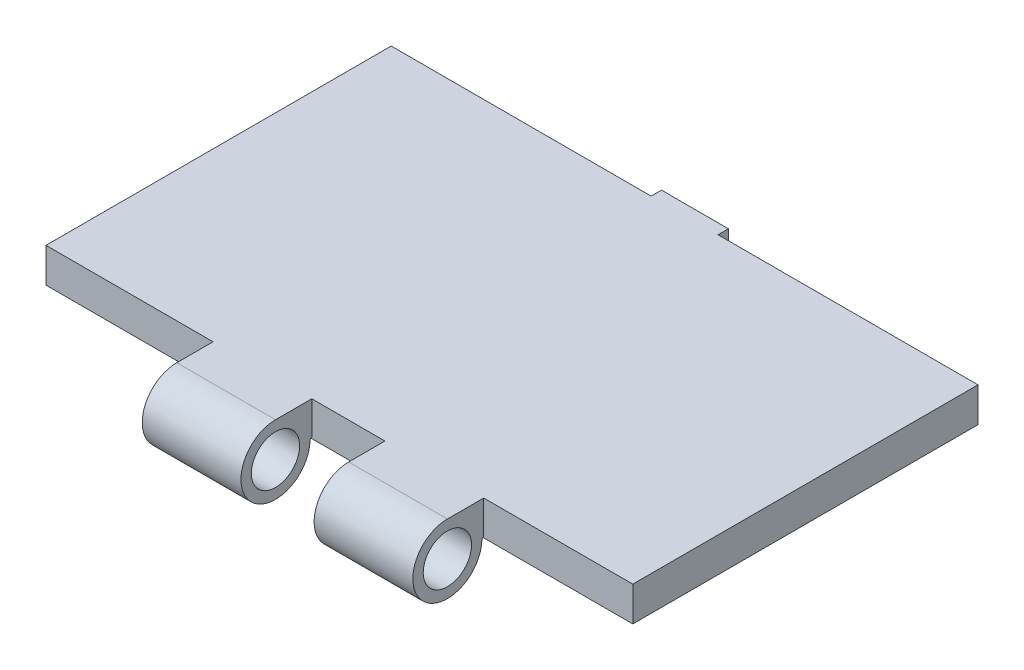
ISO-10303-21;
HEADER;
FILE_DESCRIPTION(('STEP AP214'),'2;1');
FILE_NAME('part.step','',(''),(''),'','','');
FILE_SCHEMA(('AUTOMOTIVE_DESIGN { 1 0 10303 214 1 1 1 1 }'));
ENDSEC;
DATA;
#1=APPLICATION_CONTEXT('core data for automotive mechanical design processes');
#2=APPLICATION_PROTOCOL_DEFINITION('international standard','automotive_design',2000,#1);
#3=PRODUCT_CONTEXT('',#1,'mechanical');
#4=PRODUCT('Part','Part','',(#3));
#5=PRODUCT_RELATED_PRODUCT_CATEGORY('part','',(#4));
#6=PRODUCT_DEFINITION_FORMATION('','',#4);
#7=PRODUCT_DEFINITION_CONTEXT('part definition',#1,'design');
#8=PRODUCT_DEFINITION('design','',#6,#7);
#9=PRODUCT_DEFINITION_SHAPE('','',#8);
#10=(LENGTH_UNIT() NAMED_UNIT(*) SI_UNIT(.MILLI.,.METRE.));
#11=(NAMED_UNIT(*) PLANE_ANGLE_UNIT() SI_UNIT($,.RADIAN.));
#12=(NAMED_UNIT(*) SI_UNIT($,.STERADIAN.) SOLID_ANGLE_UNIT());
#13=UNCERTAINTY_MEASURE_WITH_UNIT(LENGTH_MEASURE(1.E-05),#10,'distance_accuracy_value','');
#14=(GEOMETRIC_REPRESENTATION_CONTEXT(3) GLOBAL_UNCERTAINTY_ASSIGNED_CONTEXT((#13)) GLOBAL_UNIT_ASSIGNED_CONTEXT((#10,
#11,#12)) REPRESENTATION_CONTEXT('',''));
#15=CARTESIAN_POINT('',(0.,0.,0.));
#16=DIRECTION('',(0.,0.,1.));
#17=DIRECTION('',(1.,0.,0.));
#18=AXIS2_PLACEMENT_3D('',#15,#16,#17);
#19=CARTESIAN_POINT('',(-42.5,5.,-25.));
#20=DIRECTION('',(0.,0.,1.));
#21=DIRECTION('',(1.,0.,0.));
#22=AXIS2_PLACEMENT_3D('',#19,#20,#21);
#23=PLANE('',#22);
#24=DIRECTION('',(0.,-1.,0.));
#25=VECTOR('',#24,1.);
#26=CARTESIAN_POINT('',(-4.85,5.,-25.));
#27=LINE('',#26,#25);
#28=CARTESIAN_POINT('',(-4.85,5.,-25.));
#29=VERTEX_POINT('',#28);
#30=CARTESIAN_POINT('',(-4.85,0.,-25.));
#31=VERTEX_POINT('',#30);
#32=EDGE_CURVE('E184',#29,#31,#27,.T.);
#33=ORIENTED_EDGE('',*,*,#32,.T.);
#34=DIRECTION('',(-1.,0.,0.));
#35=VECTOR('',#34,1.);
#36=CARTESIAN_POINT('',(-42.5,0.,-25.));
#37=LINE('',#36,#35);
#38=CARTESIAN_POINT('',(-42.5,0.,-25.));
#39=VERTEX_POINT('',#38);
#40=EDGE_CURVE('E280',#31,#39,#37,.T.);
#41=ORIENTED_EDGE('',*,*,#40,.T.);
#42=DIRECTION('',(0.,-1.,0.));
#43=VECTOR('',#42,1.);
#44=CARTESIAN_POINT('',(-42.5,5.,-25.));
#45=LINE('',#44,#43);
#46=CARTESIAN_POINT('',(-42.5,5.,-25.));
#47=VERTEX_POINT('',#46);
#48=EDGE_CURVE('E43',#47,#39,#45,.T.);
#49=ORIENTED_EDGE('',*,*,#48,.F.);
#50=DIRECTION('',(-1.,0.,0.));
#51=VECTOR('',#50,1.);
#52=CARTESIAN_POINT('',(-42.5,5.,-25.));
#53=LINE('',#52,#51);
#54=EDGE_CURVE('E50',#29,#47,#53,.T.);
#55=ORIENTED_EDGE('',*,*,#54,.F.);
#56=EDGE_LOOP('',(#33,#41,#49,#55));
#57=FACE_BOUND('',#56,.T.);
#58=ADVANCED_FACE('F35',(#57),#23,.F.);
#59=CARTESIAN_POINT('',(-42.5,5.,25.));
#60=DIRECTION('',(0.,0.,-1.));
#61=DIRECTION('',(-1.,0.,0.));
#62=AXIS2_PLACEMENT_3D('',#59,#60,#61);
#63=PLANE('',#62);
#64=DIRECTION('',(0.,1.,0.));
#65=VECTOR('',#64,1.);
#66=CARTESIAN_POINT('',(20.9,5.,25.));
#67=LINE('',#66,#65);
#68=CARTESIAN_POINT('',(20.9,0.23226176038566,25.));
#69=VERTEX_POINT('',#68);
#70=CARTESIAN_POINT('',(20.9,5.,25.));
#71=VERTEX_POINT('',#70);
#72=EDGE_CURVE('E224',#69,#71,#67,.T.);
#73=ORIENTED_EDGE('',*,*,#72,.F.);
#74=DIRECTION('',(-1.,0.,0.));
#75=VECTOR('',#74,1.);
#76=CARTESIAN_POINT('',(-42.5,0.232261760385667,25.));
#77=LINE('',#76,#75);
#78=CARTESIAN_POINT('',(6.59999999999998,0.232261760385663,25.));
#79=VERTEX_POINT('',#78);
#80=EDGE_CURVE('E226',#69,#79,#77,.T.);
#81=ORIENTED_EDGE('',*,*,#80,.T.);
#82=DIRECTION('',(0.,1.,0.));
#83=VECTOR('',#82,1.);
#84=CARTESIAN_POINT('',(6.59999999999998,5.,25.));
#85=LINE('',#84,#83);
#86=CARTESIAN_POINT('',(6.59999999999998,5.,25.));
#87=VERTEX_POINT('',#86);
#88=EDGE_CURVE('E220',#79,#87,#85,.T.);
#89=ORIENTED_EDGE('',*,*,#88,.T.);
#90=DIRECTION('',(1.,0.,0.));
#91=VECTOR('',#90,1.);
#92=CARTESIAN_POINT('',(-42.5,5.,25.));
#93=LINE('',#92,#91);
#94=CARTESIAN_POINT('',(-4.00000000000002,5.,25.));
#95=VERTEX_POINT('',#94);
#96=EDGE_CURVE('E277',#95,#87,#93,.T.);
#97=ORIENTED_EDGE('',*,*,#96,.F.);
#98=DIRECTION('',(0.,1.,0.));
#99=VECTOR('',#98,1.);
#100=CARTESIAN_POINT('',(-4.00000000000002,5.,25.));
#101=LINE('',#100,#99);
#102=CARTESIAN_POINT('',(-4.00000000000002,0.23226176038566,25.));
#103=VERTEX_POINT('',#102);
#104=EDGE_CURVE('E258',#103,#95,#101,.T.);
#105=ORIENTED_EDGE('',*,*,#104,.F.);
#106=DIRECTION('',(-1.,0.,0.));
#107=VECTOR('',#106,1.);
#108=CARTESIAN_POINT('',(-42.5,0.232261760385663,25.));
#109=LINE('',#108,#107);
#110=CARTESIAN_POINT('',(-18.3,0.232261760385663,25.));
#111=VERTEX_POINT('',#110);
#112=EDGE_CURVE('E260',#103,#111,#109,.T.);
#113=ORIENTED_EDGE('',*,*,#112,.T.);
#114=DIRECTION('',(0.,1.,0.));
#115=VECTOR('',#114,1.);
#116=CARTESIAN_POINT('',(-18.3,5.,25.));
#117=LINE('',#116,#115);
#118=CARTESIAN_POINT('',(-18.3,5.,25.));
#119=VERTEX_POINT('',#118);
#120=EDGE_CURVE('E254',#111,#119,#117,.T.);
#121=ORIENTED_EDGE('',*,*,#120,.T.);
#122=CARTESIAN_POINT('',(-42.5,5.,25.));
#123=VERTEX_POINT('',#122);
#124=EDGE_CURVE('E273',#123,#119,#93,.T.);
#125=ORIENTED_EDGE('',*,*,#124,.F.);
#126=DIRECTION('',(0.,-1.,0.));
#127=VECTOR('',#126,1.);
#128=CARTESIAN_POINT('',(-42.5,5.,25.));
#129=LINE('',#128,#127);
#130=CARTESIAN_POINT('',(-42.5,0.,25.));
#131=VERTEX_POINT('',#130);
#132=EDGE_CURVE('E289',#123,#131,#129,.T.);
#133=ORIENTED_EDGE('',*,*,#132,.T.);
#134=DIRECTION('',(1.,0.,0.));
#135=VECTOR('',#134,1.);
#136=CARTESIAN_POINT('',(-42.5,0.,25.));
#137=LINE('',#136,#135);
#138=CARTESIAN_POINT('',(42.5,0.,25.));
#139=VERTEX_POINT('',#138);
#140=EDGE_CURVE('E267',#131,#139,#137,.T.);
#141=ORIENTED_EDGE('',*,*,#140,.T.);
#142=DIRECTION('',(0.,-1.,0.));
#143=VECTOR('',#142,1.);
#144=CARTESIAN_POINT('',(42.5,5.,25.));
#145=LINE('',#144,#143);
#146=CARTESIAN_POINT('',(42.5,5.,25.));
#147=VERTEX_POINT('',#146);
#148=EDGE_CURVE('E276',#147,#139,#145,.T.);
#149=ORIENTED_EDGE('',*,*,#148,.F.);
#150=EDGE_CURVE('E272',#71,#147,#93,.T.);
#151=ORIENTED_EDGE('',*,*,#150,.F.);
#152=EDGE_LOOP('',(#73,#81,#89,#97,#105,#113,#121,#125,#133,#141,#149,#151));
#153=FACE_BOUND('',#152,.T.);
#154=ADVANCED_FACE('F304',(#153),#63,.F.);
#155=CARTESIAN_POINT('',(42.5,5.,-25.));
#156=DIRECTION('',(-1.,0.,0.));
#157=DIRECTION('',(0.,0.,1.));
#158=AXIS2_PLACEMENT_3D('',#155,#156,#157);
#159=PLANE('',#158);
#160=DIRECTION('',(0.,0.,-1.));
#161=VECTOR('',#160,1.);
#162=CARTESIAN_POINT('',(42.5,0.,-25.));
#163=LINE('',#162,#161);
#164=CARTESIAN_POINT('',(42.5,0.,-25.));
#165=VERTEX_POINT('',#164);
#166=EDGE_CURVE('E263',#139,#165,#163,.T.);
#167=ORIENTED_EDGE('',*,*,#166,.T.);
#168=DIRECTION('',(0.,-1.,0.));
#169=VECTOR('',#168,1.);
#170=CARTESIAN_POINT('',(42.5,5.,-25.));
#171=LINE('',#170,#169);
#172=CARTESIAN_POINT('',(42.5,5.,-25.));
#173=VERTEX_POINT('',#172);
#174=EDGE_CURVE('E11',#173,#165,#171,.T.);
#175=ORIENTED_EDGE('',*,*,#174,.F.);
#176=DIRECTION('',(0.,0.,-1.));
#177=VECTOR('',#176,1.);
#178=CARTESIAN_POINT('',(42.5,5.,-25.));
#179=LINE('',#178,#177);
#180=EDGE_CURVE('E264',#147,#173,#179,.T.);
#181=ORIENTED_EDGE('',*,*,#180,.F.);
#182=ORIENTED_EDGE('',*,*,#148,.T.);
#183=EDGE_LOOP('',(#167,#175,#181,#182));
#184=FACE_BOUND('',#183,.T.);
#185=ADVANCED_FACE('F37',(#184),#159,.F.);
#186=CARTESIAN_POINT('',(4.85,0.,-25.));
#187=VERTEX_POINT('',#186);
#188=EDGE_CURVE('E281',#165,#187,#37,.T.);
#189=ORIENTED_EDGE('',*,*,#188,.T.);
#190=DIRECTION('',(0.,-1.,0.));
#191=VECTOR('',#190,1.);
#192=CARTESIAN_POINT('',(4.85,5.,-25.));
#193=LINE('',#192,#191);
#194=CARTESIAN_POINT('',(4.85,5.,-25.));
#195=VERTEX_POINT('',#194);
#196=EDGE_CURVE('E58',#195,#187,#193,.T.);
#197=ORIENTED_EDGE('',*,*,#196,.F.);
#198=EDGE_CURVE('E268',#173,#195,#53,.T.);
#199=ORIENTED_EDGE('',*,*,#198,.F.);
#200=ORIENTED_EDGE('',*,*,#174,.T.);
#201=EDGE_LOOP('',(#189,#197,#199,#200));
#202=FACE_BOUND('',#201,.T.);
#203=ADVANCED_FACE('F347',(#202),#23,.F.);
#204=CARTESIAN_POINT('',(-42.5,5.,-25.));
#205=DIRECTION('',(1.,0.,0.));
#206=DIRECTION('',(0.,0.,-1.));
#207=AXIS2_PLACEMENT_3D('',#204,#205,#206);
#208=PLANE('',#207);
#209=DIRECTION('',(0.,0.,1.));
#210=VECTOR('',#209,1.);
#211=CARTESIAN_POINT('',(-42.5,0.,-25.));
#212=LINE('',#211,#210);
#213=EDGE_CURVE('E283',#39,#131,#212,.T.);
#214=ORIENTED_EDGE('',*,*,#213,.T.);
#215=ORIENTED_EDGE('',*,*,#132,.F.);
#216=DIRECTION('',(0.,0.,1.));
#217=VECTOR('',#216,1.);
#218=CARTESIAN_POINT('',(-42.5,5.,-25.));
#219=LINE('',#218,#217);
#220=EDGE_CURVE('E270',#47,#123,#219,.T.);
#221=ORIENTED_EDGE('',*,*,#220,.F.);
#222=ORIENTED_EDGE('',*,*,#48,.T.);
#223=EDGE_LOOP('',(#214,#215,#221,#222));
#224=FACE_BOUND('',#223,.T.);
#225=ADVANCED_FACE('F295',(#224),#208,.F.);
#226=CARTESIAN_POINT('',(0.,5.,0.));
#227=DIRECTION('',(0.,1.,0.));
#228=DIRECTION('',(0.,0.,1.));
#229=AXIS2_PLACEMENT_3D('',#226,#227,#228);
#230=PLANE('',#229);
#231=ORIENTED_EDGE('',*,*,#96,.T.);
#232=DIRECTION('',(0.,0.,-1.));
#233=VECTOR('',#232,1.);
#234=CARTESIAN_POINT('',(6.59999999999997,5.00000000000001,0.));
#235=LINE('',#234,#233);
#236=CARTESIAN_POINT('',(6.59999999999998,5.,30.26));
#237=VERTEX_POINT('',#236);
#238=EDGE_CURVE('E214',#237,#87,#235,.T.);
#239=ORIENTED_EDGE('',*,*,#238,.F.);
#240=DIRECTION('',(-1.,0.,0.));
#241=VECTOR('',#240,1.);
#242=CARTESIAN_POINT('',(20.9,5.,30.26));
#243=LINE('',#242,#241);
#244=CARTESIAN_POINT('',(20.9,5.,30.26));
#245=VERTEX_POINT('',#244);
#246=EDGE_CURVE('E211',#245,#237,#243,.T.);
#247=ORIENTED_EDGE('',*,*,#246,.F.);
#248=DIRECTION('',(0.,0.,-1.));
#249=VECTOR('',#248,1.);
#250=CARTESIAN_POINT('',(20.9,5.00000000000001,0.));
#251=LINE('',#250,#249);
#252=EDGE_CURVE('E205',#245,#71,#251,.T.);
#253=ORIENTED_EDGE('',*,*,#252,.T.);
#254=ORIENTED_EDGE('',*,*,#150,.T.);
#255=ORIENTED_EDGE('',*,*,#180,.T.);
#256=ORIENTED_EDGE('',*,*,#198,.T.);
#257=DIRECTION('',(0.,0.,-1.));
#258=VECTOR('',#257,1.);
#259=CARTESIAN_POINT('',(4.85,5.,-25.));
#260=LINE('',#259,#258);
#261=CARTESIAN_POINT('',(4.85,5.,-26.5));
#262=VERTEX_POINT('',#261);
#263=EDGE_CURVE('E368',#195,#262,#260,.T.);
#264=ORIENTED_EDGE('',*,*,#263,.T.);
#265=DIRECTION('',(-1.,0.,0.));
#266=VECTOR('',#265,1.);
#267=CARTESIAN_POINT('',(4.85,5.,-26.5));
#268=LINE('',#267,#266);
#269=CARTESIAN_POINT('',(-4.85,5.,-26.5));
#270=VERTEX_POINT('',#269);
#271=EDGE_CURVE('E377',#262,#270,#268,.T.);
#272=ORIENTED_EDGE('',*,*,#271,.T.);
#273=DIRECTION('',(0.,0.,-1.));
#274=VECTOR('',#273,1.);
#275=CARTESIAN_POINT('',(-4.85,5.,-25.));
#276=LINE('',#275,#274);
#277=EDGE_CURVE('E364',#29,#270,#276,.T.);
#278=ORIENTED_EDGE('',*,*,#277,.F.);
#279=ORIENTED_EDGE('',*,*,#54,.T.);
#280=ORIENTED_EDGE('',*,*,#220,.T.);
#281=ORIENTED_EDGE('',*,*,#124,.T.);
#282=DIRECTION('',(0.,0.,-1.));
#283=VECTOR('',#282,1.);
#284=CARTESIAN_POINT('',(-18.3,5.00000000000001,0.));
#285=LINE('',#284,#283);
#286=CARTESIAN_POINT('',(-18.3,5.,30.26));
#287=VERTEX_POINT('',#286);
#288=EDGE_CURVE('E248',#287,#119,#285,.T.);
#289=ORIENTED_EDGE('',*,*,#288,.F.);
#290=DIRECTION('',(-1.,0.,0.));
#291=VECTOR('',#290,1.);
#292=CARTESIAN_POINT('',(-4.00000000000002,5.,30.26));
#293=LINE('',#292,#291);
#294=CARTESIAN_POINT('',(-4.00000000000002,5.,30.26));
#295=VERTEX_POINT('',#294);
#296=EDGE_CURVE('E245',#295,#287,#293,.T.);
#297=ORIENTED_EDGE('',*,*,#296,.F.);
#298=DIRECTION('',(0.,0.,-1.));
#299=VECTOR('',#298,1.);
#300=CARTESIAN_POINT('',(-4.00000000000002,5.00000000000001,0.));
#301=LINE('',#300,#299);
#302=EDGE_CURVE('E239',#295,#95,#301,.T.);
#303=ORIENTED_EDGE('',*,*,#302,.T.);
#304=EDGE_LOOP('',(#231,#239,#247,#253,#254,#255,#256,#264,#272,#278,#279,#280,#281,#289,#297,#303));
#305=FACE_BOUND('',#304,.T.);
#306=ADVANCED_FACE('F312',(#305),#230,.T.);
#307=CARTESIAN_POINT('',(0.,0.,0.));
#308=DIRECTION('',(0.,1.,0.));
#309=DIRECTION('',(0.,0.,1.));
#310=AXIS2_PLACEMENT_3D('',#307,#308,#309);
#311=PLANE('',#310);
#312=ORIENTED_EDGE('',*,*,#166,.F.);
#313=ORIENTED_EDGE('',*,*,#140,.F.);
#314=ORIENTED_EDGE('',*,*,#213,.F.);
#315=ORIENTED_EDGE('',*,*,#40,.F.);
#316=EDGE_CURVE('E284',#187,#31,#37,.T.);
#317=ORIENTED_EDGE('',*,*,#316,.F.);
#318=ORIENTED_EDGE('',*,*,#188,.F.);
#319=EDGE_LOOP('',(#312,#313,#314,#315,#317,#318));
#320=FACE_BOUND('',#319,.T.);
#321=ADVANCED_FACE('F300',(#320),#311,.F.);
#322=CARTESIAN_POINT('',(-4.00000000000002,12.5872517492197,11.6428940255396));
#323=DIRECTION('',(0.,-0.734108563674599,-0.679032117605359));
#324=DIRECTION('',(0.,0.679032117605359,-0.734108563674599));
#325=AXIS2_PLACEMENT_3D('',#322,#323,#324);
#326=PLANE('',#325);
#327=ORIENTED_EDGE('',*,*,#112,.F.);
#328=DIRECTION('',(0.,-0.679032117605359,0.734108563674599));
#329=VECTOR('',#328,1.);
#330=CARTESIAN_POINT('',(-4.00000000000002,12.5872517492197,11.6428940255396));
#331=LINE('',#330,#329);
#332=CARTESIAN_POINT('',(-4.00000000000002,-0.0082380343074547,25.2600067865255));
#333=VERTEX_POINT('',#332);
#334=EDGE_CURVE('E243',#103,#333,#331,.T.);
#335=ORIENTED_EDGE('',*,*,#334,.T.);
#336=DIRECTION('',(-1.,0.,0.));
#337=VECTOR('',#336,1.);
#338=CARTESIAN_POINT('',(-4.00000000000002,-0.0082380343074547,25.2600067865255));
#339=LINE('',#338,#337);
#340=CARTESIAN_POINT('',(-18.3,-0.0082380343074547,25.2600067865255));
#341=VERTEX_POINT('',#340);
#342=EDGE_CURVE('E251',#333,#341,#339,.T.);
#343=ORIENTED_EDGE('',*,*,#342,.T.);
#344=DIRECTION('',(0.,-0.679032117605359,0.734108563674599));
#345=VECTOR('',#344,1.);
#346=CARTESIAN_POINT('',(-18.3,12.5872517492197,11.6428940255396));
#347=LINE('',#346,#345);
#348=EDGE_CURVE('E240',#111,#341,#347,.T.);
#349=ORIENTED_EDGE('',*,*,#348,.F.);
#350=EDGE_LOOP('',(#327,#335,#343,#349));
#351=FACE_BOUND('',#350,.T.);
#352=ADVANCED_FACE('F388',(#351),#326,.T.);
#353=CARTESIAN_POINT('',(-4.00000000000002,0.,0.));
#354=DIRECTION('',(-1.,0.,0.));
#355=DIRECTION('',(0.,0.,1.));
#356=AXIS2_PLACEMENT_3D('',#353,#354,#355);
#357=PLANE('',#356);
#358=CARTESIAN_POINT('',(-4.00000000000002,0.,30.26));
#359=DIRECTION('',(-1.,0.,0.));
#360=DIRECTION('',(0.,0.,1.));
#361=AXIS2_PLACEMENT_3D('',#358,#359,#360);
#362=CIRCLE('',#361,3.5);
#363=CARTESIAN_POINT('',(-4.00000000000002,0.,33.76));
#364=VERTEX_POINT('',#363);
#365=EDGE_CURVE('E232',#364,#364,#362,.F.);
#366=ORIENTED_EDGE('',*,*,#365,.F.);
#367=EDGE_LOOP('',(#366));
#368=FACE_BOUND('',#367,.T.);
#369=ORIENTED_EDGE('',*,*,#334,.F.);
#370=ORIENTED_EDGE('',*,*,#104,.T.);
#371=ORIENTED_EDGE('',*,*,#302,.F.);
#372=CARTESIAN_POINT('',(-4.00000000000002,0.,30.26));
#373=DIRECTION('',(-1.,0.,0.));
#374=DIRECTION('',(0.,0.,1.));
#375=AXIS2_PLACEMENT_3D('',#372,#373,#374);
#376=CIRCLE('',#375,4.99999999999999);
#377=EDGE_CURVE('E236',#333,#295,#376,.T.);
#378=ORIENTED_EDGE('',*,*,#377,.F.);
#379=EDGE_LOOP('',(#369,#370,#371,#378));
#380=FACE_BOUND('',#379,.T.);
#381=ADVANCED_FACE('F396',(#368,#380),#357,.F.);
#382=CARTESIAN_POINT('',(-18.3,0.,0.));
#383=DIRECTION('',(-1.,0.,0.));
#384=DIRECTION('',(0.,0.,1.));
#385=AXIS2_PLACEMENT_3D('',#382,#383,#384);
#386=PLANE('',#385);
#387=CARTESIAN_POINT('',(-18.3,0.,30.26));
#388=DIRECTION('',(-1.,0.,0.));
#389=DIRECTION('',(0.,0.,1.));
#390=AXIS2_PLACEMENT_3D('',#387,#388,#389);
#391=CIRCLE('',#390,3.5);
#392=CARTESIAN_POINT('',(-18.3,0.,33.76));
#393=VERTEX_POINT('',#392);
#394=EDGE_CURVE('E229',#393,#393,#391,.T.);
#395=ORIENTED_EDGE('',*,*,#394,.F.);
#396=EDGE_LOOP('',(#395));
#397=FACE_BOUND('',#396,.T.);
#398=ORIENTED_EDGE('',*,*,#120,.F.);
#399=ORIENTED_EDGE('',*,*,#348,.T.);
#400=CARTESIAN_POINT('',(-18.3,0.,30.26));
#401=DIRECTION('',(-1.,0.,0.));
#402=DIRECTION('',(0.,0.,1.));
#403=AXIS2_PLACEMENT_3D('',#400,#401,#402);
#404=CIRCLE('',#403,4.99999999999999);
#405=EDGE_CURVE('E235',#341,#287,#404,.T.);
#406=ORIENTED_EDGE('',*,*,#405,.T.);
#407=ORIENTED_EDGE('',*,*,#288,.T.);
#408=EDGE_LOOP('',(#398,#399,#406,#407));
#409=FACE_BOUND('',#408,.T.);
#410=ADVANCED_FACE('F386',(#397,#409),#386,.T.);
#411=CARTESIAN_POINT('',(-4.00000000000002,0.,30.26));
#412=DIRECTION('',(-1.,0.,0.));
#413=DIRECTION('',(0.,0.,1.));
#414=AXIS2_PLACEMENT_3D('',#411,#412,#413);
#415=CYLINDRICAL_SURFACE('',#414,4.99999999999999);
#416=ORIENTED_EDGE('',*,*,#405,.F.);
#417=ORIENTED_EDGE('',*,*,#342,.F.);
#418=ORIENTED_EDGE('',*,*,#377,.T.);
#419=ORIENTED_EDGE('',*,*,#296,.T.);
#420=EDGE_LOOP('',(#416,#417,#418,#419));
#421=FACE_BOUND('',#420,.T.);
#422=ADVANCED_FACE('F394',(#421),#415,.T.);
#423=CARTESIAN_POINT('',(5.89949493661165,0.,30.26));
#424=DIRECTION('',(-1.,0.,0.));
#425=DIRECTION('',(0.,0.,1.));
#426=AXIS2_PLACEMENT_3D('',#423,#424,#425);
#427=CYLINDRICAL_SURFACE('',#426,3.5);
#428=ORIENTED_EDGE('',*,*,#365,.T.);
#429=EDGE_LOOP('',(#428));
#430=FACE_BOUND('',#429,.T.);
#431=ORIENTED_EDGE('',*,*,#394,.T.);
#432=EDGE_LOOP('',(#431));
#433=FACE_BOUND('',#432,.T.);
#434=ADVANCED_FACE('F342',(#430,#433),#427,.F.);
#435=CARTESIAN_POINT('',(20.9,12.5872517492197,11.6428940255396));
#436=DIRECTION('',(0.,-0.734108563674599,-0.679032117605359));
#437=DIRECTION('',(0.,0.679032117605359,-0.734108563674599));
#438=AXIS2_PLACEMENT_3D('',#435,#436,#437);
#439=PLANE('',#438);
#440=ORIENTED_EDGE('',*,*,#80,.F.);
#441=DIRECTION('',(0.,-0.679032117605359,0.734108563674599));
#442=VECTOR('',#441,1.);
#443=CARTESIAN_POINT('',(20.9,12.5872517492197,11.6428940255396));
#444=LINE('',#443,#442);
#445=CARTESIAN_POINT('',(20.9,-0.00823803430745424,25.2600067865255));
#446=VERTEX_POINT('',#445);
#447=EDGE_CURVE('E209',#69,#446,#444,.T.);
#448=ORIENTED_EDGE('',*,*,#447,.T.);
#449=DIRECTION('',(-1.,0.,0.));
#450=VECTOR('',#449,1.);
#451=CARTESIAN_POINT('',(20.9,-0.00823803430745424,25.2600067865255));
#452=LINE('',#451,#450);
#453=CARTESIAN_POINT('',(6.59999999999998,-0.00823803430745424,25.2600067865255));
#454=VERTEX_POINT('',#453);
#455=EDGE_CURVE('E217',#446,#454,#452,.T.);
#456=ORIENTED_EDGE('',*,*,#455,.T.);
#457=DIRECTION('',(0.,-0.679032117605359,0.734108563674599));
#458=VECTOR('',#457,1.);
#459=CARTESIAN_POINT('',(6.59999999999998,12.5872517492197,11.6428940255396));
#460=LINE('',#459,#458);
#461=EDGE_CURVE('E206',#79,#454,#460,.T.);
#462=ORIENTED_EDGE('',*,*,#461,.F.);
#463=EDGE_LOOP('',(#440,#448,#456,#462));
#464=FACE_BOUND('',#463,.T.);
#465=ADVANCED_FACE('F324',(#464),#439,.T.);
#466=CARTESIAN_POINT('',(20.9,0.,0.));
#467=DIRECTION('',(-1.,0.,0.));
#468=DIRECTION('',(0.,0.,1.));
#469=AXIS2_PLACEMENT_3D('',#466,#467,#468);
#470=PLANE('',#469);
#471=CARTESIAN_POINT('',(20.9,0.,30.26));
#472=DIRECTION('',(-1.,0.,0.));
#473=DIRECTION('',(0.,0.,1.));
#474=AXIS2_PLACEMENT_3D('',#471,#472,#473);
#475=CIRCLE('',#474,3.5);
#476=CARTESIAN_POINT('',(20.9,0.,33.76));
#477=VERTEX_POINT('',#476);
#478=EDGE_CURVE('E198',#477,#477,#475,.F.);
#479=ORIENTED_EDGE('',*,*,#478,.F.);
#480=EDGE_LOOP('',(#479));
#481=FACE_BOUND('',#480,.T.);
#482=ORIENTED_EDGE('',*,*,#447,.F.);
#483=ORIENTED_EDGE('',*,*,#72,.T.);
#484=ORIENTED_EDGE('',*,*,#252,.F.);
#485=CARTESIAN_POINT('',(20.9,0.,30.26));
#486=DIRECTION('',(-1.,0.,0.));
#487=DIRECTION('',(0.,0.,1.));
#488=AXIS2_PLACEMENT_3D('',#485,#486,#487);
#489=CIRCLE('',#488,4.99999999999999);
#490=EDGE_CURVE('E202',#446,#245,#489,.T.);
#491=ORIENTED_EDGE('',*,*,#490,.F.);
#492=EDGE_LOOP('',(#482,#483,#484,#491));
#493=FACE_BOUND('',#492,.T.);
#494=ADVANCED_FACE('F332',(#481,#493),#470,.F.);
#495=CARTESIAN_POINT('',(6.59999999999997,0.,0.));
#496=DIRECTION('',(-1.,0.,0.));
#497=DIRECTION('',(0.,0.,1.));
#498=AXIS2_PLACEMENT_3D('',#495,#496,#497);
#499=PLANE('',#498);
#500=CARTESIAN_POINT('',(6.59999999999998,0.,30.26));
#501=DIRECTION('',(-1.,0.,0.));
#502=DIRECTION('',(0.,0.,1.));
#503=AXIS2_PLACEMENT_3D('',#500,#501,#502);
#504=CIRCLE('',#503,3.5);
#505=CARTESIAN_POINT('',(6.59999999999998,0.,33.76));
#506=VERTEX_POINT('',#505);
#507=EDGE_CURVE('E194',#506,#506,#504,.T.);
#508=ORIENTED_EDGE('',*,*,#507,.F.);
#509=EDGE_LOOP('',(#508));
#510=FACE_BOUND('',#509,.T.);
#511=ORIENTED_EDGE('',*,*,#88,.F.);
#512=ORIENTED_EDGE('',*,*,#461,.T.);
#513=CARTESIAN_POINT('',(6.59999999999998,0.,30.26));
#514=DIRECTION('',(-1.,0.,0.));
#515=DIRECTION('',(0.,0.,1.));
#516=AXIS2_PLACEMENT_3D('',#513,#514,#515);
#517=CIRCLE('',#516,4.99999999999999);
#518=EDGE_CURVE('E201',#454,#237,#517,.T.);
#519=ORIENTED_EDGE('',*,*,#518,.T.);
#520=ORIENTED_EDGE('',*,*,#238,.T.);
#521=EDGE_LOOP('',(#511,#512,#519,#520));
#522=FACE_BOUND('',#521,.T.);
#523=ADVANCED_FACE('F322',(#510,#522),#499,.T.);
#524=CARTESIAN_POINT('',(20.9,0.,30.26));
#525=DIRECTION('',(-1.,0.,0.));
#526=DIRECTION('',(0.,0.,1.));
#527=AXIS2_PLACEMENT_3D('',#524,#525,#526);
#528=CYLINDRICAL_SURFACE('',#527,4.99999999999999);
#529=ORIENTED_EDGE('',*,*,#518,.F.);
#530=ORIENTED_EDGE('',*,*,#455,.F.);
#531=ORIENTED_EDGE('',*,*,#490,.T.);
#532=ORIENTED_EDGE('',*,*,#246,.T.);
#533=EDGE_LOOP('',(#529,#530,#531,#532));
#534=FACE_BOUND('',#533,.T.);
#535=ADVANCED_FACE('F330',(#534),#528,.T.);
#536=CARTESIAN_POINT('',(27.0994949366117,0.,30.26));
#537=DIRECTION('',(-1.,0.,0.));
#538=DIRECTION('',(0.,0.,1.));
#539=AXIS2_PLACEMENT_3D('',#536,#537,#538);
#540=CYLINDRICAL_SURFACE('',#539,3.5);
#541=ORIENTED_EDGE('',*,*,#478,.T.);
#542=EDGE_LOOP('',(#541));
#543=FACE_BOUND('',#542,.T.);
#544=ORIENTED_EDGE('',*,*,#507,.T.);
#545=EDGE_LOOP('',(#544));
#546=FACE_BOUND('',#545,.T.);
#547=ADVANCED_FACE('F490',(#543,#546),#540,.F.);
#548=CARTESIAN_POINT('',(4.85,5.,-25.));
#549=DIRECTION('',(0.,0.,-1.));
#550=DIRECTION('',(-1.,0.,0.));
#551=AXIS2_PLACEMENT_3D('',#548,#549,#550);
#552=PLANE('',#551);
#553=CARTESIAN_POINT('',(4.85,-2.5,-25.));
#554=VERTEX_POINT('',#553);
#555=EDGE_CURVE('E361',#187,#554,#193,.T.);
#556=ORIENTED_EDGE('',*,*,#555,.F.);
#557=ORIENTED_EDGE('',*,*,#316,.T.);
#558=CARTESIAN_POINT('',(-4.85,-2.5,-25.));
#559=VERTEX_POINT('',#558);
#560=EDGE_CURVE('E382',#31,#559,#27,.T.);
#561=ORIENTED_EDGE('',*,*,#560,.T.);
#562=DIRECTION('',(1.,0.,0.));
#563=VECTOR('',#562,1.);
#564=CARTESIAN_POINT('',(-4.85,-2.5,-25.));
#565=LINE('',#564,#563);
#566=EDGE_CURVE('E172',#559,#554,#565,.T.);
#567=ORIENTED_EDGE('',*,*,#566,.T.);
#568=EDGE_LOOP('',(#556,#557,#561,#567));
#569=FACE_BOUND('',#568,.T.);
#570=ADVANCED_FACE('F362',(#569),#552,.F.);
#571=CARTESIAN_POINT('',(4.85,0.,0.));
#572=DIRECTION('',(1.,0.,0.));
#573=DIRECTION('',(0.,0.,-1.));
#574=AXIS2_PLACEMENT_3D('',#571,#572,#573);
#575=PLANE('',#574);
#576=CARTESIAN_POINT('',(4.85,-3.25,-25.));
#577=DIRECTION('',(1.,0.,0.));
#578=DIRECTION('',(0.,0.,-1.));
#579=AXIS2_PLACEMENT_3D('',#576,#577,#578);
#580=CIRCLE('',#579,0.75);
#581=CARTESIAN_POINT('',(4.85,-4.,-25.));
#582=VERTEX_POINT('',#581);
#583=EDGE_CURVE('E188',#582,#554,#580,.F.);
#584=ORIENTED_EDGE('',*,*,#583,.F.);
#585=DIRECTION('',(0.,0.,-1.));
#586=VECTOR('',#585,1.);
#587=CARTESIAN_POINT('',(4.85,-4.,-25.));
#588=LINE('',#587,#586);
#589=CARTESIAN_POINT('',(4.85,-4.,-26.5));
#590=VERTEX_POINT('',#589);
#591=EDGE_CURVE('E167',#582,#590,#588,.T.);
#592=ORIENTED_EDGE('',*,*,#591,.T.);
#593=DIRECTION('',(0.,-1.,0.));
#594=VECTOR('',#593,1.);
#595=CARTESIAN_POINT('',(4.85,5.,-26.5));
#596=LINE('',#595,#594);
#597=EDGE_CURVE('E369',#262,#590,#596,.T.);
#598=ORIENTED_EDGE('',*,*,#597,.F.);
#599=ORIENTED_EDGE('',*,*,#263,.F.);
#600=ORIENTED_EDGE('',*,*,#196,.T.);
#601=ORIENTED_EDGE('',*,*,#555,.T.);
#602=EDGE_LOOP('',(#584,#592,#598,#599,#600,#601));
#603=FACE_BOUND('',#602,.T.);
#604=ADVANCED_FACE('F366',(#603),#575,.T.);
#605=CARTESIAN_POINT('',(4.85,-4.,-25.));
#606=DIRECTION('',(0.,1.,0.));
#607=DIRECTION('',(0.,0.,1.));
#608=AXIS2_PLACEMENT_3D('',#605,#606,#607);
#609=PLANE('',#608);
#610=ORIENTED_EDGE('',*,*,#591,.F.);
#611=DIRECTION('',(1.,0.,0.));
#612=VECTOR('',#611,1.);
#613=CARTESIAN_POINT('',(-4.85,-4.,-25.));
#614=LINE('',#613,#612);
#615=CARTESIAN_POINT('',(-4.85,-4.,-25.));
#616=VERTEX_POINT('',#615);
#617=EDGE_CURVE('E162',#616,#582,#614,.T.);
#618=ORIENTED_EDGE('',*,*,#617,.F.);
#619=DIRECTION('',(0.,0.,-1.));
#620=VECTOR('',#619,1.);
#621=CARTESIAN_POINT('',(-4.85,-4.,-25.));
#622=LINE('',#621,#620);
#623=CARTESIAN_POINT('',(-4.85,-4.,-26.5));
#624=VERTEX_POINT('',#623);
#625=EDGE_CURVE('E166',#616,#624,#622,.T.);
#626=ORIENTED_EDGE('',*,*,#625,.T.);
#627=DIRECTION('',(-1.,0.,0.));
#628=VECTOR('',#627,1.);
#629=CARTESIAN_POINT('',(4.85,-4.,-26.5));
#630=LINE('',#629,#628);
#631=EDGE_CURVE('E190',#590,#624,#630,.T.);
#632=ORIENTED_EDGE('',*,*,#631,.F.);
#633=EDGE_LOOP('',(#610,#618,#626,#632));
#634=FACE_BOUND('',#633,.T.);
#635=ADVANCED_FACE('F164',(#634),#609,.F.);
#636=CARTESIAN_POINT('',(4.85,5.,-26.5));
#637=DIRECTION('',(0.,0.,-1.));
#638=DIRECTION('',(-1.,0.,0.));
#639=AXIS2_PLACEMENT_3D('',#636,#637,#638);
#640=PLANE('',#639);
#641=ORIENTED_EDGE('',*,*,#631,.T.);
#642=DIRECTION('',(0.,-1.,0.));
#643=VECTOR('',#642,1.);
#644=CARTESIAN_POINT('',(-4.85,5.,-26.5));
#645=LINE('',#644,#643);
#646=EDGE_CURVE('E183',#270,#624,#645,.T.);
#647=ORIENTED_EDGE('',*,*,#646,.F.);
#648=ORIENTED_EDGE('',*,*,#271,.F.);
#649=ORIENTED_EDGE('',*,*,#597,.T.);
#650=EDGE_LOOP('',(#641,#647,#648,#649));
#651=FACE_BOUND('',#650,.T.);
#652=ADVANCED_FACE('F379',(#651),#640,.T.);
#653=CARTESIAN_POINT('',(-4.85,-3.25,-25.));
#654=DIRECTION('',(1.,0.,0.));
#655=DIRECTION('',(0.,0.,-1.));
#656=AXIS2_PLACEMENT_3D('',#653,#654,#655);
#657=CYLINDRICAL_SURFACE('',#656,0.75);
#658=ORIENTED_EDGE('',*,*,#617,.T.);
#659=ORIENTED_EDGE('',*,*,#583,.T.);
#660=ORIENTED_EDGE('',*,*,#566,.F.);
#661=CARTESIAN_POINT('',(-4.85,-3.25,-25.));
#662=DIRECTION('',(1.,0.,0.));
#663=DIRECTION('',(0.,0.,-1.));
#664=AXIS2_PLACEMENT_3D('',#661,#662,#663);
#665=CIRCLE('',#664,0.75);
#666=EDGE_CURVE('E173',#616,#559,#665,.F.);
#667=ORIENTED_EDGE('',*,*,#666,.F.);
#668=EDGE_LOOP('',(#658,#659,#660,#667));
#669=FACE_BOUND('',#668,.T.);
#670=ADVANCED_FACE('F186',(#669),#657,.T.);
#671=CARTESIAN_POINT('',(-4.85,0.,0.));
#672=DIRECTION('',(1.,0.,0.));
#673=DIRECTION('',(0.,0.,-1.));
#674=AXIS2_PLACEMENT_3D('',#671,#672,#673);
#675=PLANE('',#674);
#676=ORIENTED_EDGE('',*,*,#666,.T.);
#677=ORIENTED_EDGE('',*,*,#560,.F.);
#678=ORIENTED_EDGE('',*,*,#32,.F.);
#679=ORIENTED_EDGE('',*,*,#277,.T.);
#680=ORIENTED_EDGE('',*,*,#646,.T.);
#681=ORIENTED_EDGE('',*,*,#625,.F.);
#682=EDGE_LOOP('',(#676,#677,#678,#679,#680,#681));
#683=FACE_BOUND('',#682,.T.);
#684=ADVANCED_FACE('F178',(#683),#675,.F.);
#685=CLOSED_SHELL('',(#58,#154,#185,#203,#225,#306,#321,#352,#381,#410,#422,#434,#465,#494,#523,
#535,#547,#570,#604,#635,#652,#670,#684));
#686=MANIFOLD_SOLID_BREP('B2',#685);
#687=ADVANCED_BREP_SHAPE_REPRESENTATION('',(#18,#686),#14);
#688=SHAPE_DEFINITION_REPRESENTATION(#9,#687);
ENDSEC;
END-ISO-10303-21;
